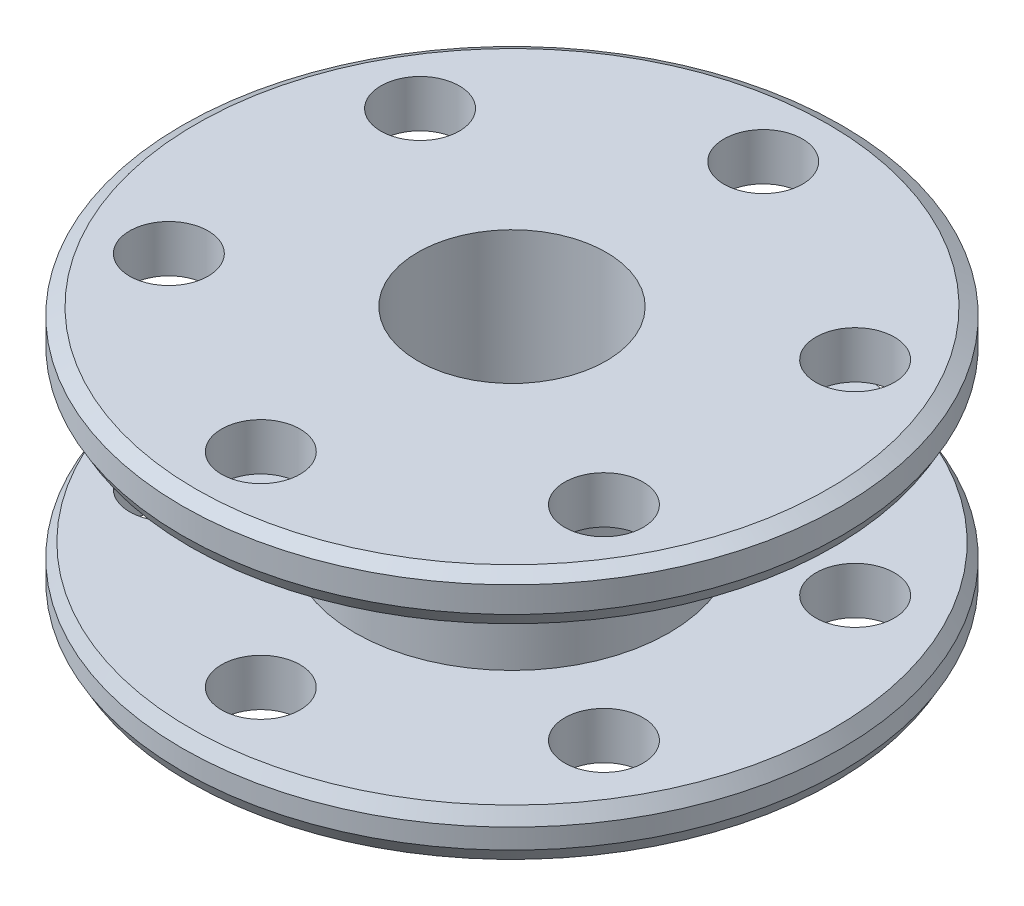
ISO-10303-21;
HEADER;
FILE_DESCRIPTION(('STEP AP214'),'2;1');
FILE_NAME('part.step','',(''),(''),'','','');
FILE_SCHEMA(('AUTOMOTIVE_DESIGN { 1 0 10303 214 1 1 1 1 }'));
ENDSEC;
DATA;
#1=APPLICATION_CONTEXT('core data for automotive mechanical design processes');
#2=APPLICATION_PROTOCOL_DEFINITION('international standard','automotive_design',2000,#1);
#3=PRODUCT_CONTEXT('',#1,'mechanical');
#4=PRODUCT('Part','Part','',(#3));
#5=PRODUCT_RELATED_PRODUCT_CATEGORY('part','',(#4));
#6=PRODUCT_DEFINITION_FORMATION('','',#4);
#7=PRODUCT_DEFINITION_CONTEXT('part definition',#1,'design');
#8=PRODUCT_DEFINITION('design','',#6,#7);
#9=PRODUCT_DEFINITION_SHAPE('','',#8);
#10=(LENGTH_UNIT() NAMED_UNIT(*) SI_UNIT(.MILLI.,.METRE.));
#11=(NAMED_UNIT(*) PLANE_ANGLE_UNIT() SI_UNIT($,.RADIAN.));
#12=(NAMED_UNIT(*) SI_UNIT($,.STERADIAN.) SOLID_ANGLE_UNIT());
#13=UNCERTAINTY_MEASURE_WITH_UNIT(LENGTH_MEASURE(1.E-05),#10,'distance_accuracy_value','');
#14=(GEOMETRIC_REPRESENTATION_CONTEXT(3) GLOBAL_UNCERTAINTY_ASSIGNED_CONTEXT((#13)) GLOBAL_UNIT_ASSIGNED_CONTEXT((#10,
#11,#12)) REPRESENTATION_CONTEXT('',''));
#15=CARTESIAN_POINT('',(0.,0.,0.));
#16=DIRECTION('',(0.,0.,1.));
#17=DIRECTION('',(1.,0.,0.));
#18=AXIS2_PLACEMENT_3D('',#15,#16,#17);
#19=CARTESIAN_POINT('',(0.,16.,0.));
#20=DIRECTION('',(0.,-1.,0.));
#21=DIRECTION('',(0.,0.,-1.));
#22=AXIS2_PLACEMENT_3D('',#19,#20,#21);
#23=CYLINDRICAL_SURFACE('',#22,21.);
#24=CARTESIAN_POINT('',(0.,0.86602540378445,0.));
#25=DIRECTION('',(0.,1.,0.));
#26=DIRECTION('',(0.,0.,1.));
#27=AXIS2_PLACEMENT_3D('',#24,#25,#26);
#28=CIRCLE('',#27,21.);
#29=CARTESIAN_POINT('',(0.,0.86602540378445,21.));
#30=VERTEX_POINT('',#29);
#31=EDGE_CURVE('E72',#30,#30,#28,.T.);
#32=ORIENTED_EDGE('',*,*,#31,.T.);
#33=EDGE_LOOP('',(#32));
#34=FACE_BOUND('',#33,.T.);
#35=CARTESIAN_POINT('',(0.,2.13397459621554,0.));
#36=DIRECTION('',(0.,-1.,0.));
#37=DIRECTION('',(0.,0.,-1.));
#38=AXIS2_PLACEMENT_3D('',#35,#36,#37);
#39=CIRCLE('',#38,21.);
#40=CARTESIAN_POINT('',(0.,2.13397459621554,-21.));
#41=VERTEX_POINT('',#40);
#42=EDGE_CURVE('E76',#41,#41,#39,.T.);
#43=ORIENTED_EDGE('',*,*,#42,.T.);
#44=EDGE_LOOP('',(#43));
#45=FACE_BOUND('',#44,.T.);
#46=ADVANCED_FACE('F39',(#34,#45),#23,.T.);
#47=CARTESIAN_POINT('',(0.,16.,-16.));
#48=DIRECTION('',(0.,-1.,0.));
#49=DIRECTION('',(0.,0.,-1.));
#50=AXIS2_PLACEMENT_3D('',#47,#48,#49);
#51=CYLINDRICAL_SURFACE('',#50,2.5);
#52=CARTESIAN_POINT('',(0.,3.,-16.));
#53=DIRECTION('',(0.,-1.,0.));
#54=DIRECTION('',(0.,0.,-1.));
#55=AXIS2_PLACEMENT_3D('',#52,#53,#54);
#56=CIRCLE('',#55,2.5);
#57=CARTESIAN_POINT('',(0.,3.,-18.5));
#58=VERTEX_POINT('',#57);
#59=EDGE_CURVE('E145',#58,#58,#56,.T.);
#60=ORIENTED_EDGE('',*,*,#59,.F.);
#61=EDGE_LOOP('',(#60));
#62=FACE_BOUND('',#61,.T.);
#63=CARTESIAN_POINT('',(0.,0.,-16.));
#64=DIRECTION('',(0.,1.,0.));
#65=DIRECTION('',(0.,0.,1.));
#66=AXIS2_PLACEMENT_3D('',#63,#64,#65);
#67=CIRCLE('',#66,2.5);
#68=CARTESIAN_POINT('',(0.,0.,-13.5));
#69=VERTEX_POINT('',#68);
#70=EDGE_CURVE('E101',#69,#69,#67,.T.);
#71=ORIENTED_EDGE('',*,*,#70,.F.);
#72=EDGE_LOOP('',(#71));
#73=FACE_BOUND('',#72,.T.);
#74=ADVANCED_FACE('F218',(#62,#73),#51,.F.);
#75=CARTESIAN_POINT('',(13.8564064605515,16.,-8.00000000000079));
#76=DIRECTION('',(0.,-1.,0.));
#77=DIRECTION('',(0.,0.,-1.));
#78=AXIS2_PLACEMENT_3D('',#75,#76,#77);
#79=CYLINDRICAL_SURFACE('',#78,2.50000000000024);
#80=CARTESIAN_POINT('',(13.8564064605515,3.,-8.00000000000079));
#81=DIRECTION('',(0.,-1.,0.));
#82=DIRECTION('',(0.,0.,-1.));
#83=AXIS2_PLACEMENT_3D('',#80,#81,#82);
#84=CIRCLE('',#83,2.50000000000024);
#85=CARTESIAN_POINT('',(13.8564064605515,3.,-10.500000000001));
#86=VERTEX_POINT('',#85);
#87=EDGE_CURVE('E152',#86,#86,#84,.T.);
#88=ORIENTED_EDGE('',*,*,#87,.F.);
#89=EDGE_LOOP('',(#88));
#90=FACE_BOUND('',#89,.T.);
#91=CARTESIAN_POINT('',(13.8564064605515,0.,-8.00000000000079));
#92=DIRECTION('',(0.,1.,0.));
#93=DIRECTION('',(0.,0.,1.));
#94=AXIS2_PLACEMENT_3D('',#91,#92,#93);
#95=CIRCLE('',#94,2.50000000000024);
#96=CARTESIAN_POINT('',(13.8564064605515,0.,-5.50000000000055));
#97=VERTEX_POINT('',#96);
#98=EDGE_CURVE('E109',#97,#97,#95,.T.);
#99=ORIENTED_EDGE('',*,*,#98,.F.);
#100=EDGE_LOOP('',(#99));
#101=FACE_BOUND('',#100,.T.);
#102=ADVANCED_FACE('F261',(#90,#101),#79,.F.);
#103=CARTESIAN_POINT('',(13.8564064605524,16.,7.99999999999921));
#104=DIRECTION('',(0.,-1.,0.));
#105=DIRECTION('',(0.,0.,-1.));
#106=AXIS2_PLACEMENT_3D('',#103,#104,#105);
#107=CYLINDRICAL_SURFACE('',#106,2.50000000000115);
#108=CARTESIAN_POINT('',(13.8564064605524,3.,7.99999999999921));
#109=DIRECTION('',(0.,-1.,0.));
#110=DIRECTION('',(0.,0.,-1.));
#111=AXIS2_PLACEMENT_3D('',#108,#109,#110);
#112=CIRCLE('',#111,2.50000000000115);
#113=CARTESIAN_POINT('',(13.8564064605524,3.,5.49999999999807));
#114=VERTEX_POINT('',#113);
#115=EDGE_CURVE('E156',#114,#114,#112,.T.);
#116=ORIENTED_EDGE('',*,*,#115,.F.);
#117=EDGE_LOOP('',(#116));
#118=FACE_BOUND('',#117,.T.);
#119=CARTESIAN_POINT('',(13.8564064605524,0.,7.99999999999921));
#120=DIRECTION('',(0.,1.,0.));
#121=DIRECTION('',(0.,0.,1.));
#122=AXIS2_PLACEMENT_3D('',#119,#120,#121);
#123=CIRCLE('',#122,2.50000000000115);
#124=CARTESIAN_POINT('',(13.8564064605524,0.,10.5000000000004));
#125=VERTEX_POINT('',#124);
#126=EDGE_CURVE('E117',#125,#125,#123,.T.);
#127=ORIENTED_EDGE('',*,*,#126,.F.);
#128=EDGE_LOOP('',(#127));
#129=FACE_BOUND('',#128,.T.);
#130=ADVANCED_FACE('F332',(#118,#129),#107,.F.);
#131=CARTESIAN_POINT('',(1.81311109890995E-12,16.,16.));
#132=DIRECTION('',(0.,-1.,0.));
#133=DIRECTION('',(0.,0.,-1.));
#134=AXIS2_PLACEMENT_3D('',#131,#132,#133);
#135=CYLINDRICAL_SURFACE('',#134,2.50000000000184);
#136=CARTESIAN_POINT('',(1.81311109890995E-12,3.,16.));
#137=DIRECTION('',(0.,-1.,0.));
#138=DIRECTION('',(0.,0.,-1.));
#139=AXIS2_PLACEMENT_3D('',#136,#137,#138);
#140=CIRCLE('',#139,2.50000000000184);
#141=CARTESIAN_POINT('',(1.81311109890995E-12,3.,13.4999999999982));
#142=VERTEX_POINT('',#141);
#143=EDGE_CURVE('E160',#142,#142,#140,.T.);
#144=ORIENTED_EDGE('',*,*,#143,.F.);
#145=EDGE_LOOP('',(#144));
#146=FACE_BOUND('',#145,.T.);
#147=CARTESIAN_POINT('',(1.81311109890995E-12,0.,16.));
#148=DIRECTION('',(0.,1.,0.));
#149=DIRECTION('',(0.,0.,1.));
#150=AXIS2_PLACEMENT_3D('',#147,#148,#149);
#151=CIRCLE('',#150,2.50000000000184);
#152=CARTESIAN_POINT('',(1.81311109890995E-12,0.,18.5000000000018));
#153=VERTEX_POINT('',#152);
#154=EDGE_CURVE('E125',#153,#153,#151,.T.);
#155=ORIENTED_EDGE('',*,*,#154,.F.);
#156=EDGE_LOOP('',(#155));
#157=FACE_BOUND('',#156,.T.);
#158=ADVANCED_FACE('F327',(#146,#157),#135,.F.);
#159=CARTESIAN_POINT('',(-13.8564064605497,16.,8.00000000000079));
#160=DIRECTION('',(0.,-1.,0.));
#161=DIRECTION('',(0.,0.,-1.));
#162=AXIS2_PLACEMENT_3D('',#159,#160,#161);
#163=CYLINDRICAL_SURFACE('',#162,2.50000000000168);
#164=CARTESIAN_POINT('',(-13.8564064605497,3.,8.00000000000079));
#165=DIRECTION('',(0.,-1.,0.));
#166=DIRECTION('',(0.,0.,-1.));
#167=AXIS2_PLACEMENT_3D('',#164,#165,#166);
#168=CIRCLE('',#167,2.50000000000168);
#169=CARTESIAN_POINT('',(-13.8564064605497,3.,5.49999999999911));
#170=VERTEX_POINT('',#169);
#171=EDGE_CURVE('E85',#170,#170,#168,.T.);
#172=ORIENTED_EDGE('',*,*,#171,.F.);
#173=EDGE_LOOP('',(#172));
#174=FACE_BOUND('',#173,.T.);
#175=CARTESIAN_POINT('',(-13.8564064605497,0.,8.00000000000079));
#176=DIRECTION('',(0.,1.,0.));
#177=DIRECTION('',(0.,0.,1.));
#178=AXIS2_PLACEMENT_3D('',#175,#176,#177);
#179=CIRCLE('',#178,2.50000000000168);
#180=CARTESIAN_POINT('',(-13.8564064605497,0.,10.5000000000025));
#181=VERTEX_POINT('',#180);
#182=EDGE_CURVE('E133',#181,#181,#179,.T.);
#183=ORIENTED_EDGE('',*,*,#182,.F.);
#184=EDGE_LOOP('',(#183));
#185=FACE_BOUND('',#184,.T.);
#186=ADVANCED_FACE('F250',(#174,#185),#163,.F.);
#187=CARTESIAN_POINT('',(-13.8564064605506,16.,-7.99999999999921));
#188=DIRECTION('',(0.,-1.,0.));
#189=DIRECTION('',(0.,0.,-1.));
#190=AXIS2_PLACEMENT_3D('',#187,#188,#189);
#191=CYLINDRICAL_SURFACE('',#190,2.50000000000085);
#192=CARTESIAN_POINT('',(-13.8564064605506,3.,-7.99999999999921));
#193=DIRECTION('',(0.,-1.,0.));
#194=DIRECTION('',(0.,0.,-1.));
#195=AXIS2_PLACEMENT_3D('',#192,#193,#194);
#196=CIRCLE('',#195,2.50000000000085);
#197=CARTESIAN_POINT('',(-13.8564064605506,3.,-10.5000000000001));
#198=VERTEX_POINT('',#197);
#199=EDGE_CURVE('E81',#198,#198,#196,.T.);
#200=ORIENTED_EDGE('',*,*,#199,.F.);
#201=EDGE_LOOP('',(#200));
#202=FACE_BOUND('',#201,.T.);
#203=CARTESIAN_POINT('',(-13.8564064605506,0.,-7.99999999999921));
#204=DIRECTION('',(0.,1.,0.));
#205=DIRECTION('',(0.,0.,1.));
#206=AXIS2_PLACEMENT_3D('',#203,#204,#205);
#207=CIRCLE('',#206,2.50000000000085);
#208=CARTESIAN_POINT('',(-13.8564064605506,0.,-5.49999999999836));
#209=VERTEX_POINT('',#208);
#210=EDGE_CURVE('E141',#209,#209,#207,.T.);
#211=ORIENTED_EDGE('',*,*,#210,.F.);
#212=EDGE_LOOP('',(#211));
#213=FACE_BOUND('',#212,.T.);
#214=ADVANCED_FACE('F225',(#202,#213),#191,.F.);
#215=CARTESIAN_POINT('',(0.,16.,0.));
#216=DIRECTION('',(0.,1.,0.));
#217=DIRECTION('',(0.,0.,1.));
#218=AXIS2_PLACEMENT_3D('',#215,#216,#217);
#219=PLANE('',#218);
#220=CARTESIAN_POINT('',(0.,16.,0.));
#221=DIRECTION('',(0.,1.,0.));
#222=DIRECTION('',(0.,0.,1.));
#223=AXIS2_PLACEMENT_3D('',#220,#221,#222);
#224=CIRCLE('',#223,20.1339745962156);
#225=CARTESIAN_POINT('',(0.,16.,20.1339745962156));
#226=VERTEX_POINT('',#225);
#227=EDGE_CURVE('E58',#226,#226,#224,.T.);
#228=ORIENTED_EDGE('',*,*,#227,.T.);
#229=EDGE_LOOP('',(#228));
#230=FACE_BOUND('',#229,.T.);
#231=CARTESIAN_POINT('',(-13.8564064605497,16.,8.00000000000079));
#232=DIRECTION('',(0.,1.,0.));
#233=DIRECTION('',(0.,0.,1.));
#234=AXIS2_PLACEMENT_3D('',#231,#232,#233);
#235=CIRCLE('',#234,2.50000000000168);
#236=CARTESIAN_POINT('',(-13.8564064605497,16.,10.5000000000025));
#237=VERTEX_POINT('',#236);
#238=EDGE_CURVE('E129',#237,#237,#235,.T.);
#239=ORIENTED_EDGE('',*,*,#238,.F.);
#240=EDGE_LOOP('',(#239));
#241=FACE_BOUND('',#240,.T.);
#242=CARTESIAN_POINT('',(13.8564064605524,16.,7.99999999999921));
#243=DIRECTION('',(0.,1.,0.));
#244=DIRECTION('',(0.,0.,1.));
#245=AXIS2_PLACEMENT_3D('',#242,#243,#244);
#246=CIRCLE('',#245,2.50000000000115);
#247=CARTESIAN_POINT('',(13.8564064605524,16.,10.5000000000004));
#248=VERTEX_POINT('',#247);
#249=EDGE_CURVE('E113',#248,#248,#246,.T.);
#250=ORIENTED_EDGE('',*,*,#249,.F.);
#251=EDGE_LOOP('',(#250));
#252=FACE_BOUND('',#251,.T.);
#253=CARTESIAN_POINT('',(0.,16.,-16.));
#254=DIRECTION('',(0.,1.,0.));
#255=DIRECTION('',(0.,0.,1.));
#256=AXIS2_PLACEMENT_3D('',#253,#254,#255);
#257=CIRCLE('',#256,2.5);
#258=CARTESIAN_POINT('',(0.,16.,-13.5));
#259=VERTEX_POINT('',#258);
#260=EDGE_CURVE('E97',#259,#259,#257,.T.);
#261=ORIENTED_EDGE('',*,*,#260,.F.);
#262=EDGE_LOOP('',(#261));
#263=FACE_BOUND('',#262,.T.);
#264=CARTESIAN_POINT('',(0.,16.,0.));
#265=DIRECTION('',(0.,1.,0.));
#266=DIRECTION('',(0.,0.,1.));
#267=AXIS2_PLACEMENT_3D('',#264,#265,#266);
#268=CIRCLE('',#267,6.);
#269=CARTESIAN_POINT('',(0.,16.,6.));
#270=VERTEX_POINT('',#269);
#271=EDGE_CURVE('E80',#270,#270,#268,.T.);
#272=ORIENTED_EDGE('',*,*,#271,.F.);
#273=EDGE_LOOP('',(#272));
#274=FACE_BOUND('',#273,.T.);
#275=CARTESIAN_POINT('',(13.8564064605515,16.,-8.00000000000079));
#276=DIRECTION('',(0.,1.,0.));
#277=DIRECTION('',(0.,0.,1.));
#278=AXIS2_PLACEMENT_3D('',#275,#276,#277);
#279=CIRCLE('',#278,2.50000000000024);
#280=CARTESIAN_POINT('',(13.8564064605515,16.,-5.50000000000055));
#281=VERTEX_POINT('',#280);
#282=EDGE_CURVE('E105',#281,#281,#279,.T.);
#283=ORIENTED_EDGE('',*,*,#282,.F.);
#284=EDGE_LOOP('',(#283));
#285=FACE_BOUND('',#284,.T.);
#286=CARTESIAN_POINT('',(1.81311109890995E-12,16.,16.));
#287=DIRECTION('',(0.,1.,0.));
#288=DIRECTION('',(0.,0.,1.));
#289=AXIS2_PLACEMENT_3D('',#286,#287,#288);
#290=CIRCLE('',#289,2.50000000000184);
#291=CARTESIAN_POINT('',(1.81311109890995E-12,16.,18.5000000000018));
#292=VERTEX_POINT('',#291);
#293=EDGE_CURVE('E121',#292,#292,#290,.T.);
#294=ORIENTED_EDGE('',*,*,#293,.F.);
#295=EDGE_LOOP('',(#294));
#296=FACE_BOUND('',#295,.T.);
#297=CARTESIAN_POINT('',(-13.8564064605506,16.,-7.99999999999921));
#298=DIRECTION('',(0.,1.,0.));
#299=DIRECTION('',(0.,0.,1.));
#300=AXIS2_PLACEMENT_3D('',#297,#298,#299);
#301=CIRCLE('',#300,2.50000000000085);
#302=CARTESIAN_POINT('',(-13.8564064605506,16.,-5.49999999999836));
#303=VERTEX_POINT('',#302);
#304=EDGE_CURVE('E137',#303,#303,#301,.T.);
#305=ORIENTED_EDGE('',*,*,#304,.F.);
#306=EDGE_LOOP('',(#305));
#307=FACE_BOUND('',#306,.T.);
#308=ADVANCED_FACE('F221',(#230,#241,#252,#263,#274,#285,#296,#307),#219,.T.);
#309=CARTESIAN_POINT('',(0.,0.,0.));
#310=DIRECTION('',(0.,1.,0.));
#311=DIRECTION('',(0.,0.,1.));
#312=AXIS2_PLACEMENT_3D('',#309,#310,#311);
#313=PLANE('',#312);
#314=CARTESIAN_POINT('',(0.,0.,0.));
#315=DIRECTION('',(0.,1.,0.));
#316=DIRECTION('',(0.,0.,1.));
#317=AXIS2_PLACEMENT_3D('',#314,#315,#316);
#318=CIRCLE('',#317,20.5);
#319=CARTESIAN_POINT('',(0.,0.,20.5));
#320=VERTEX_POINT('',#319);
#321=EDGE_CURVE('E68',#320,#320,#318,.F.);
#322=ORIENTED_EDGE('',*,*,#321,.T.);
#323=EDGE_LOOP('',(#322));
#324=FACE_BOUND('',#323,.T.);
#325=CARTESIAN_POINT('',(0.,0.,0.));
#326=DIRECTION('',(0.,1.,0.));
#327=DIRECTION('',(0.,0.,1.));
#328=AXIS2_PLACEMENT_3D('',#325,#326,#327);
#329=CIRCLE('',#328,6.);
#330=CARTESIAN_POINT('',(0.,0.,6.));
#331=VERTEX_POINT('',#330);
#332=EDGE_CURVE('E93',#331,#331,#329,.T.);
#333=ORIENTED_EDGE('',*,*,#332,.T.);
#334=EDGE_LOOP('',(#333));
#335=FACE_BOUND('',#334,.T.);
#336=ORIENTED_EDGE('',*,*,#70,.T.);
#337=EDGE_LOOP('',(#336));
#338=FACE_BOUND('',#337,.T.);
#339=ORIENTED_EDGE('',*,*,#98,.T.);
#340=EDGE_LOOP('',(#339));
#341=FACE_BOUND('',#340,.T.);
#342=ORIENTED_EDGE('',*,*,#126,.T.);
#343=EDGE_LOOP('',(#342));
#344=FACE_BOUND('',#343,.T.);
#345=ORIENTED_EDGE('',*,*,#154,.T.);
#346=EDGE_LOOP('',(#345));
#347=FACE_BOUND('',#346,.T.);
#348=ORIENTED_EDGE('',*,*,#182,.T.);
#349=EDGE_LOOP('',(#348));
#350=FACE_BOUND('',#349,.T.);
#351=ORIENTED_EDGE('',*,*,#210,.T.);
#352=EDGE_LOOP('',(#351));
#353=FACE_BOUND('',#352,.T.);
#354=ADVANCED_FACE('F224',(#324,#335,#338,#341,#344,#347,#350,#353),#313,.F.);
#355=CARTESIAN_POINT('',(0.,15.5,0.));
#356=DIRECTION('',(0.,1.,0.));
#357=DIRECTION('',(0.,0.,1.));
#358=AXIS2_PLACEMENT_3D('',#355,#356,#357);
#359=CIRCLE('',#358,21.);
#360=CARTESIAN_POINT('',(0.,15.5,21.));
#361=VERTEX_POINT('',#360);
#362=EDGE_CURVE('E48',#361,#361,#359,.F.);
#363=ORIENTED_EDGE('',*,*,#362,.T.);
#364=EDGE_LOOP('',(#363));
#365=FACE_BOUND('',#364,.T.);
#366=CARTESIAN_POINT('',(0.,13.8660254037845,0.));
#367=DIRECTION('',(0.,1.,0.));
#368=DIRECTION('',(0.,0.,1.));
#369=AXIS2_PLACEMENT_3D('',#366,#367,#368);
#370=CIRCLE('',#369,21.);
#371=CARTESIAN_POINT('',(0.,13.8660254037845,21.));
#372=VERTEX_POINT('',#371);
#373=EDGE_CURVE('E53',#372,#372,#370,.T.);
#374=ORIENTED_EDGE('',*,*,#373,.T.);
#375=EDGE_LOOP('',(#374));
#376=FACE_BOUND('',#375,.T.);
#377=ADVANCED_FACE('F257',(#365,#376),#23,.T.);
#378=CARTESIAN_POINT('',(0.,16.,0.));
#379=DIRECTION('',(0.,-1.,0.));
#380=DIRECTION('',(0.,0.,-1.));
#381=AXIS2_PLACEMENT_3D('',#378,#379,#380);
#382=CYLINDRICAL_SURFACE('',#381,6.);
#383=ORIENTED_EDGE('',*,*,#271,.T.);
#384=EDGE_LOOP('',(#383));
#385=FACE_BOUND('',#384,.T.);
#386=ORIENTED_EDGE('',*,*,#332,.F.);
#387=EDGE_LOOP('',(#386));
#388=FACE_BOUND('',#387,.T.);
#389=ADVANCED_FACE('F216',(#385,#388),#382,.F.);
#390=CARTESIAN_POINT('',(0.,13.,-16.));
#391=DIRECTION('',(0.,1.,0.));
#392=DIRECTION('',(0.,0.,1.));
#393=AXIS2_PLACEMENT_3D('',#390,#391,#392);
#394=CIRCLE('',#393,2.5);
#395=CARTESIAN_POINT('',(0.,13.,-13.5));
#396=VERTEX_POINT('',#395);
#397=EDGE_CURVE('E86',#396,#396,#394,.T.);
#398=ORIENTED_EDGE('',*,*,#397,.F.);
#399=EDGE_LOOP('',(#398));
#400=FACE_BOUND('',#399,.T.);
#401=ORIENTED_EDGE('',*,*,#260,.T.);
#402=EDGE_LOOP('',(#401));
#403=FACE_BOUND('',#402,.T.);
#404=ADVANCED_FACE('F212',(#400,#403),#51,.F.);
#405=CARTESIAN_POINT('',(13.8564064605515,13.,-8.00000000000079));
#406=DIRECTION('',(0.,1.,0.));
#407=DIRECTION('',(0.,0.,1.));
#408=AXIS2_PLACEMENT_3D('',#405,#406,#407);
#409=CIRCLE('',#408,2.50000000000024);
#410=CARTESIAN_POINT('',(13.8564064605515,13.,-5.50000000000055));
#411=VERTEX_POINT('',#410);
#412=EDGE_CURVE('E170',#411,#411,#409,.T.);
#413=ORIENTED_EDGE('',*,*,#412,.F.);
#414=EDGE_LOOP('',(#413));
#415=FACE_BOUND('',#414,.T.);
#416=ORIENTED_EDGE('',*,*,#282,.T.);
#417=EDGE_LOOP('',(#416));
#418=FACE_BOUND('',#417,.T.);
#419=ADVANCED_FACE('F215',(#415,#418),#79,.F.);
#420=CARTESIAN_POINT('',(13.8564064605524,13.,7.99999999999921));
#421=DIRECTION('',(0.,1.,0.));
#422=DIRECTION('',(0.,0.,1.));
#423=AXIS2_PLACEMENT_3D('',#420,#421,#422);
#424=CIRCLE('',#423,2.50000000000115);
#425=CARTESIAN_POINT('',(13.8564064605524,13.,10.5000000000004));
#426=VERTEX_POINT('',#425);
#427=EDGE_CURVE('E174',#426,#426,#424,.T.);
#428=ORIENTED_EDGE('',*,*,#427,.F.);
#429=EDGE_LOOP('',(#428));
#430=FACE_BOUND('',#429,.T.);
#431=ORIENTED_EDGE('',*,*,#249,.T.);
#432=EDGE_LOOP('',(#431));
#433=FACE_BOUND('',#432,.T.);
#434=ADVANCED_FACE('F338',(#430,#433),#107,.F.);
#435=CARTESIAN_POINT('',(1.81311109890995E-12,13.,16.));
#436=DIRECTION('',(0.,1.,0.));
#437=DIRECTION('',(0.,0.,1.));
#438=AXIS2_PLACEMENT_3D('',#435,#436,#437);
#439=CIRCLE('',#438,2.50000000000184);
#440=CARTESIAN_POINT('',(1.81311109890995E-12,13.,18.5000000000018));
#441=VERTEX_POINT('',#440);
#442=EDGE_CURVE('E178',#441,#441,#439,.T.);
#443=ORIENTED_EDGE('',*,*,#442,.F.);
#444=EDGE_LOOP('',(#443));
#445=FACE_BOUND('',#444,.T.);
#446=ORIENTED_EDGE('',*,*,#293,.T.);
#447=EDGE_LOOP('',(#446));
#448=FACE_BOUND('',#447,.T.);
#449=ADVANCED_FACE('F247',(#445,#448),#135,.F.);
#450=CARTESIAN_POINT('',(-13.8564064605497,13.,8.00000000000079));
#451=DIRECTION('',(0.,1.,0.));
#452=DIRECTION('',(0.,0.,1.));
#453=AXIS2_PLACEMENT_3D('',#450,#451,#452);
#454=CIRCLE('',#453,2.50000000000168);
#455=CARTESIAN_POINT('',(-13.8564064605497,13.,10.5000000000025));
#456=VERTEX_POINT('',#455);
#457=EDGE_CURVE('E91',#456,#456,#454,.T.);
#458=ORIENTED_EDGE('',*,*,#457,.F.);
#459=EDGE_LOOP('',(#458));
#460=FACE_BOUND('',#459,.T.);
#461=ORIENTED_EDGE('',*,*,#238,.T.);
#462=EDGE_LOOP('',(#461));
#463=FACE_BOUND('',#462,.T.);
#464=ADVANCED_FACE('F238',(#460,#463),#163,.F.);
#465=CARTESIAN_POINT('',(-13.8564064605506,13.,-7.99999999999921));
#466=DIRECTION('',(0.,1.,0.));
#467=DIRECTION('',(0.,0.,1.));
#468=AXIS2_PLACEMENT_3D('',#465,#466,#467);
#469=CIRCLE('',#468,2.50000000000085);
#470=CARTESIAN_POINT('',(-13.8564064605506,13.,-5.49999999999836));
#471=VERTEX_POINT('',#470);
#472=EDGE_CURVE('E87',#471,#471,#469,.T.);
#473=ORIENTED_EDGE('',*,*,#472,.F.);
#474=EDGE_LOOP('',(#473));
#475=FACE_BOUND('',#474,.T.);
#476=ORIENTED_EDGE('',*,*,#304,.T.);
#477=EDGE_LOOP('',(#476));
#478=FACE_BOUND('',#477,.T.);
#479=ADVANCED_FACE('F236',(#475,#478),#191,.F.);
#480=CARTESIAN_POINT('',(0.,3.,-10.));
#481=DIRECTION('',(0.,-1.,0.));
#482=DIRECTION('',(0.,0.,-1.));
#483=AXIS2_PLACEMENT_3D('',#480,#481,#482);
#484=PLANE('',#483);
#485=CARTESIAN_POINT('',(0.,3.,0.));
#486=DIRECTION('',(0.,-1.,0.));
#487=DIRECTION('',(0.,0.,-1.));
#488=AXIS2_PLACEMENT_3D('',#485,#486,#487);
#489=CIRCLE('',#488,20.5);
#490=CARTESIAN_POINT('',(0.,3.,-20.5));
#491=VERTEX_POINT('',#490);
#492=EDGE_CURVE('E64',#491,#491,#489,.F.);
#493=ORIENTED_EDGE('',*,*,#492,.T.);
#494=EDGE_LOOP('',(#493));
#495=FACE_BOUND('',#494,.T.);
#496=CARTESIAN_POINT('',(0.,3.,0.));
#497=DIRECTION('',(0.,-1.,0.));
#498=DIRECTION('',(0.,0.,-1.));
#499=AXIS2_PLACEMENT_3D('',#496,#497,#498);
#500=CIRCLE('',#499,10.);
#501=CARTESIAN_POINT('',(0.,3.,-10.));
#502=VERTEX_POINT('',#501);
#503=EDGE_CURVE('E92',#502,#502,#500,.T.);
#504=ORIENTED_EDGE('',*,*,#503,.T.);
#505=EDGE_LOOP('',(#504));
#506=FACE_BOUND('',#505,.T.);
#507=ORIENTED_EDGE('',*,*,#199,.T.);
#508=EDGE_LOOP('',(#507));
#509=FACE_BOUND('',#508,.T.);
#510=ORIENTED_EDGE('',*,*,#171,.T.);
#511=EDGE_LOOP('',(#510));
#512=FACE_BOUND('',#511,.T.);
#513=ORIENTED_EDGE('',*,*,#143,.T.);
#514=EDGE_LOOP('',(#513));
#515=FACE_BOUND('',#514,.T.);
#516=ORIENTED_EDGE('',*,*,#115,.T.);
#517=EDGE_LOOP('',(#516));
#518=FACE_BOUND('',#517,.T.);
#519=ORIENTED_EDGE('',*,*,#87,.T.);
#520=EDGE_LOOP('',(#519));
#521=FACE_BOUND('',#520,.T.);
#522=ORIENTED_EDGE('',*,*,#59,.T.);
#523=EDGE_LOOP('',(#522));
#524=FACE_BOUND('',#523,.T.);
#525=ADVANCED_FACE('F198',(#495,#506,#509,#512,#515,#518,#521,#524),#484,.F.);
#526=CARTESIAN_POINT('',(0.,13.,-10.));
#527=DIRECTION('',(0.,1.,0.));
#528=DIRECTION('',(0.,0.,1.));
#529=AXIS2_PLACEMENT_3D('',#526,#527,#528);
#530=PLANE('',#529);
#531=CARTESIAN_POINT('',(0.,13.,0.));
#532=DIRECTION('',(0.,1.,0.));
#533=DIRECTION('',(0.,0.,1.));
#534=AXIS2_PLACEMENT_3D('',#531,#532,#533);
#535=CIRCLE('',#534,20.5);
#536=CARTESIAN_POINT('',(0.,13.,20.5));
#537=VERTEX_POINT('',#536);
#538=EDGE_CURVE('E10',#537,#537,#535,.F.);
#539=ORIENTED_EDGE('',*,*,#538,.T.);
#540=EDGE_LOOP('',(#539));
#541=FACE_BOUND('',#540,.T.);
#542=CARTESIAN_POINT('',(0.,13.,0.));
#543=DIRECTION('',(0.,-1.,0.));
#544=DIRECTION('',(0.,0.,-1.));
#545=AXIS2_PLACEMENT_3D('',#542,#543,#544);
#546=CIRCLE('',#545,10.);
#547=CARTESIAN_POINT('',(0.,13.,-10.));
#548=VERTEX_POINT('',#547);
#549=EDGE_CURVE('E188',#548,#548,#546,.T.);
#550=ORIENTED_EDGE('',*,*,#549,.F.);
#551=EDGE_LOOP('',(#550));
#552=FACE_BOUND('',#551,.T.);
#553=ORIENTED_EDGE('',*,*,#472,.T.);
#554=EDGE_LOOP('',(#553));
#555=FACE_BOUND('',#554,.T.);
#556=ORIENTED_EDGE('',*,*,#457,.T.);
#557=EDGE_LOOP('',(#556));
#558=FACE_BOUND('',#557,.T.);
#559=ORIENTED_EDGE('',*,*,#442,.T.);
#560=EDGE_LOOP('',(#559));
#561=FACE_BOUND('',#560,.T.);
#562=ORIENTED_EDGE('',*,*,#427,.T.);
#563=EDGE_LOOP('',(#562));
#564=FACE_BOUND('',#563,.T.);
#565=ORIENTED_EDGE('',*,*,#412,.T.);
#566=EDGE_LOOP('',(#565));
#567=FACE_BOUND('',#566,.T.);
#568=ORIENTED_EDGE('',*,*,#397,.T.);
#569=EDGE_LOOP('',(#568));
#570=FACE_BOUND('',#569,.T.);
#571=ADVANCED_FACE('F195',(#541,#552,#555,#558,#561,#564,#567,#570),#530,.F.);
#572=CARTESIAN_POINT('',(0.,0.,0.));
#573=DIRECTION('',(0.,-1.,0.));
#574=DIRECTION('',(0.,0.,-1.));
#575=AXIS2_PLACEMENT_3D('',#572,#573,#574);
#576=CYLINDRICAL_SURFACE('',#575,10.);
#577=ORIENTED_EDGE('',*,*,#503,.F.);
#578=EDGE_LOOP('',(#577));
#579=FACE_BOUND('',#578,.T.);
#580=ORIENTED_EDGE('',*,*,#549,.T.);
#581=EDGE_LOOP('',(#580));
#582=FACE_BOUND('',#581,.T.);
#583=ADVANCED_FACE('F193',(#579,#582),#576,.T.);
#584=CARTESIAN_POINT('',(0.,0.86602540378445,0.));
#585=DIRECTION('',(0.,1.,0.));
#586=DIRECTION('',(0.,0.,1.));
#587=AXIS2_PLACEMENT_3D('',#584,#585,#586);
#588=CONICAL_SURFACE('',#587,21.,0.523598775598297);
#589=ORIENTED_EDGE('',*,*,#321,.F.);
#590=EDGE_LOOP('',(#589));
#591=FACE_BOUND('',#590,.T.);
#592=ORIENTED_EDGE('',*,*,#31,.F.);
#593=EDGE_LOOP('',(#592));
#594=FACE_BOUND('',#593,.T.);
#595=ADVANCED_FACE('F288',(#591,#594),#588,.T.);
#596=CARTESIAN_POINT('',(0.,2.13397459621554,0.));
#597=DIRECTION('',(0.,-1.,0.));
#598=DIRECTION('',(0.,0.,-1.));
#599=AXIS2_PLACEMENT_3D('',#596,#597,#598);
#600=CONICAL_SURFACE('',#599,21.,0.523598775598293);
#601=ORIENTED_EDGE('',*,*,#492,.F.);
#602=EDGE_LOOP('',(#601));
#603=FACE_BOUND('',#602,.T.);
#604=ORIENTED_EDGE('',*,*,#42,.F.);
#605=EDGE_LOOP('',(#604));
#606=FACE_BOUND('',#605,.T.);
#607=ADVANCED_FACE('F283',(#603,#606),#600,.T.);
#608=CARTESIAN_POINT('',(0.,16.,0.));
#609=DIRECTION('',(0.,-1.,0.));
#610=DIRECTION('',(0.,0.,-1.));
#611=AXIS2_PLACEMENT_3D('',#608,#609,#610);
#612=CONICAL_SURFACE('',#611,20.1339745962156,1.04719755119659);
#613=ORIENTED_EDGE('',*,*,#362,.F.);
#614=EDGE_LOOP('',(#613));
#615=FACE_BOUND('',#614,.T.);
#616=ORIENTED_EDGE('',*,*,#227,.F.);
#617=EDGE_LOOP('',(#616));
#618=FACE_BOUND('',#617,.T.);
#619=ADVANCED_FACE('F278',(#615,#618),#612,.T.);
#620=CARTESIAN_POINT('',(0.,13.8660254037845,0.));
#621=DIRECTION('',(0.,1.,0.));
#622=DIRECTION('',(0.,0.,1.));
#623=AXIS2_PLACEMENT_3D('',#620,#621,#622);
#624=CONICAL_SURFACE('',#623,21.,0.523598775598294);
#625=ORIENTED_EDGE('',*,*,#538,.F.);
#626=EDGE_LOOP('',(#625));
#627=FACE_BOUND('',#626,.T.);
#628=ORIENTED_EDGE('',*,*,#373,.F.);
#629=EDGE_LOOP('',(#628));
#630=FACE_BOUND('',#629,.T.);
#631=ADVANCED_FACE('F42',(#627,#630),#624,.T.);
#632=CLOSED_SHELL('',(#46,#74,#102,#130,#158,#186,#214,#308,#354,#377,#389,#404,#419,#434,#449,
#464,#479,#525,#571,#583,#595,#607,#619,#631));
#633=MANIFOLD_SOLID_BREP('B2',#632);
#634=ADVANCED_BREP_SHAPE_REPRESENTATION('',(#18,#633),#14);
#635=SHAPE_DEFINITION_REPRESENTATION(#9,#634);
ENDSEC;
END-ISO-10303-21;
